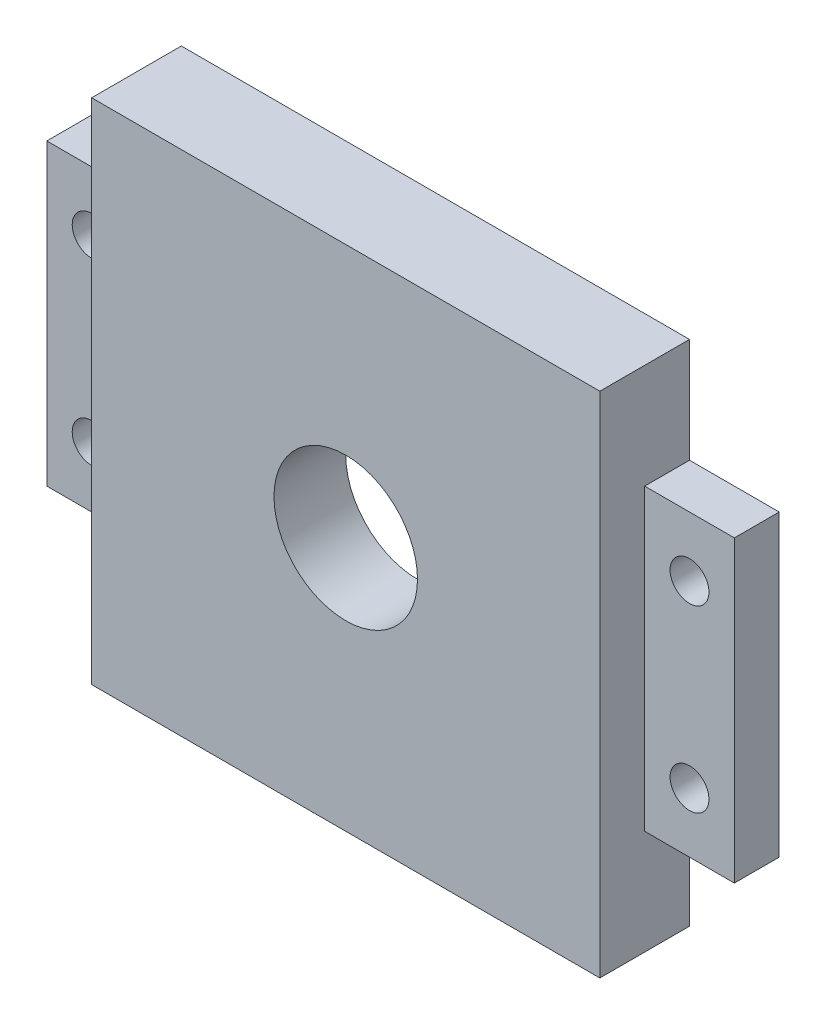
ISO-10303-21;
HEADER;
FILE_DESCRIPTION(('STEP AP214'),'2;1');
FILE_NAME('part.step','',(''),(''),'','','');
FILE_SCHEMA(('AUTOMOTIVE_DESIGN { 1 0 10303 214 1 1 1 1 }'));
ENDSEC;
DATA;
#1=APPLICATION_CONTEXT('core data for automotive mechanical design processes');
#2=APPLICATION_PROTOCOL_DEFINITION('international standard','automotive_design',2000,#1);
#3=PRODUCT_CONTEXT('',#1,'mechanical');
#4=PRODUCT('Part','Part','',(#3));
#5=PRODUCT_RELATED_PRODUCT_CATEGORY('part','',(#4));
#6=PRODUCT_DEFINITION_FORMATION('','',#4);
#7=PRODUCT_DEFINITION_CONTEXT('part definition',#1,'design');
#8=PRODUCT_DEFINITION('design','',#6,#7);
#9=PRODUCT_DEFINITION_SHAPE('','',#8);
#10=(LENGTH_UNIT() NAMED_UNIT(*) SI_UNIT(.MILLI.,.METRE.));
#11=(NAMED_UNIT(*) PLANE_ANGLE_UNIT() SI_UNIT($,.RADIAN.));
#12=(NAMED_UNIT(*) SI_UNIT($,.STERADIAN.) SOLID_ANGLE_UNIT());
#13=UNCERTAINTY_MEASURE_WITH_UNIT(LENGTH_MEASURE(1.E-05),#10,'distance_accuracy_value','');
#14=(GEOMETRIC_REPRESENTATION_CONTEXT(3) GLOBAL_UNCERTAINTY_ASSIGNED_CONTEXT((#13)) GLOBAL_UNIT_ASSIGNED_CONTEXT((#10,
#11,#12)) REPRESENTATION_CONTEXT('',''));
#15=CARTESIAN_POINT('',(0.,0.,0.));
#16=DIRECTION('',(0.,0.,1.));
#17=DIRECTION('',(1.,0.,0.));
#18=AXIS2_PLACEMENT_3D('',#15,#16,#17);
#19=CARTESIAN_POINT('',(0.,0.,15.));
#20=DIRECTION('',(0.,0.,-1.));
#21=DIRECTION('',(-1.,0.,0.));
#22=AXIS2_PLACEMENT_3D('',#19,#20,#21);
#23=CYLINDRICAL_SURFACE('',#22,12.);
#24=CARTESIAN_POINT('',(0.,0.,15.));
#25=DIRECTION('',(0.,0.,1.));
#26=DIRECTION('',(1.,0.,0.));
#27=AXIS2_PLACEMENT_3D('',#24,#25,#26);
#28=CIRCLE('',#27,12.);
#29=CARTESIAN_POINT('',(12.,0.,15.));
#30=VERTEX_POINT('',#29);
#31=EDGE_CURVE('E382',#30,#30,#28,.T.);
#32=ORIENTED_EDGE('',*,*,#31,.T.);
#33=EDGE_LOOP('',(#32));
#34=FACE_BOUND('',#33,.T.);
#35=CARTESIAN_POINT('',(0.,0.,3.));
#36=DIRECTION('',(0.,0.,-1.));
#37=DIRECTION('',(-1.,0.,0.));
#38=AXIS2_PLACEMENT_3D('',#35,#36,#37);
#39=CIRCLE('',#38,12.);
#40=CARTESIAN_POINT('',(-12.,0.,3.));
#41=VERTEX_POINT('',#40);
#42=EDGE_CURVE('E50',#41,#41,#39,.T.);
#43=ORIENTED_EDGE('',*,*,#42,.T.);
#44=EDGE_LOOP('',(#43));
#45=FACE_BOUND('',#44,.T.);
#46=ADVANCED_FACE('F45',(#34,#45),#23,.F.);
#47=CARTESIAN_POINT('',(-57.5,25.,15.));
#48=DIRECTION('',(0.,-1.,0.));
#49=DIRECTION('',(1.,0.,0.));
#50=AXIS2_PLACEMENT_3D('',#47,#48,#49);
#51=PLANE('',#50);
#52=DIRECTION('',(-1.,0.,0.));
#53=VECTOR('',#52,1.);
#54=CARTESIAN_POINT('',(-57.5,25.,7.5));
#55=LINE('',#54,#53);
#56=CARTESIAN_POINT('',(-42.5,25.,7.5));
#57=VERTEX_POINT('',#56);
#58=CARTESIAN_POINT('',(-57.5,25.,7.5));
#59=VERTEX_POINT('',#58);
#60=EDGE_CURVE('E139',#57,#59,#55,.T.);
#61=ORIENTED_EDGE('',*,*,#60,.F.);
#62=DIRECTION('',(0.,0.,-1.));
#63=VECTOR('',#62,1.);
#64=CARTESIAN_POINT('',(-42.5,25.,15.));
#65=LINE('',#64,#63);
#66=CARTESIAN_POINT('',(-42.5,25.,0.));
#67=VERTEX_POINT('',#66);
#68=EDGE_CURVE('E164',#57,#67,#65,.T.);
#69=ORIENTED_EDGE('',*,*,#68,.T.);
#70=DIRECTION('',(-1.,0.,0.));
#71=VECTOR('',#70,1.);
#72=CARTESIAN_POINT('',(-57.5,25.,0.));
#73=LINE('',#72,#71);
#74=CARTESIAN_POINT('',(-57.5,25.,0.));
#75=VERTEX_POINT('',#74);
#76=EDGE_CURVE('E414',#67,#75,#73,.T.);
#77=ORIENTED_EDGE('',*,*,#76,.T.);
#78=DIRECTION('',(0.,0.,-1.));
#79=VECTOR('',#78,1.);
#80=CARTESIAN_POINT('',(-57.5,25.,15.));
#81=LINE('',#80,#79);
#82=EDGE_CURVE('E160',#59,#75,#81,.T.);
#83=ORIENTED_EDGE('',*,*,#82,.F.);
#84=EDGE_LOOP('',(#61,#69,#77,#83));
#85=FACE_BOUND('',#84,.T.);
#86=ADVANCED_FACE('F240',(#85),#51,.F.);
#87=CARTESIAN_POINT('',(-57.5,-25.,15.));
#88=DIRECTION('',(1.,0.,0.));
#89=DIRECTION('',(0.,0.,-1.));
#90=AXIS2_PLACEMENT_3D('',#87,#88,#89);
#91=PLANE('',#90);
#92=DIRECTION('',(0.,-1.,0.));
#93=VECTOR('',#92,1.);
#94=CARTESIAN_POINT('',(-57.5,25.,7.5));
#95=LINE('',#94,#93);
#96=CARTESIAN_POINT('',(-57.5,-25.,7.5));
#97=VERTEX_POINT('',#96);
#98=EDGE_CURVE('E135',#59,#97,#95,.T.);
#99=ORIENTED_EDGE('',*,*,#98,.F.);
#100=ORIENTED_EDGE('',*,*,#82,.T.);
#101=DIRECTION('',(0.,-1.,0.));
#102=VECTOR('',#101,1.);
#103=CARTESIAN_POINT('',(-57.5,-25.,0.));
#104=LINE('',#103,#102);
#105=CARTESIAN_POINT('',(-57.5,-25.,0.));
#106=VERTEX_POINT('',#105);
#107=EDGE_CURVE('E157',#75,#106,#104,.T.);
#108=ORIENTED_EDGE('',*,*,#107,.T.);
#109=DIRECTION('',(0.,0.,-1.));
#110=VECTOR('',#109,1.);
#111=CARTESIAN_POINT('',(-57.5,-25.,15.));
#112=LINE('',#111,#110);
#113=EDGE_CURVE('E149',#97,#106,#112,.T.);
#114=ORIENTED_EDGE('',*,*,#113,.F.);
#115=EDGE_LOOP('',(#99,#100,#108,#114));
#116=FACE_BOUND('',#115,.T.);
#117=ADVANCED_FACE('F155',(#116),#91,.F.);
#118=CARTESIAN_POINT('',(-57.5,-25.,15.));
#119=DIRECTION('',(0.,1.,0.));
#120=DIRECTION('',(-1.,0.,0.));
#121=AXIS2_PLACEMENT_3D('',#118,#119,#120);
#122=PLANE('',#121);
#123=DIRECTION('',(1.,0.,0.));
#124=VECTOR('',#123,1.);
#125=CARTESIAN_POINT('',(-57.5,-25.,7.5));
#126=LINE('',#125,#124);
#127=CARTESIAN_POINT('',(-42.5,-25.,7.5));
#128=VERTEX_POINT('',#127);
#129=EDGE_CURVE('E63',#97,#128,#126,.T.);
#130=ORIENTED_EDGE('',*,*,#129,.F.);
#131=ORIENTED_EDGE('',*,*,#113,.T.);
#132=DIRECTION('',(1.,0.,0.));
#133=VECTOR('',#132,1.);
#134=CARTESIAN_POINT('',(-57.5,-25.,0.));
#135=LINE('',#134,#133);
#136=CARTESIAN_POINT('',(-42.5,-25.,0.));
#137=VERTEX_POINT('',#136);
#138=EDGE_CURVE('E420',#106,#137,#135,.T.);
#139=ORIENTED_EDGE('',*,*,#138,.T.);
#140=DIRECTION('',(0.,0.,-1.));
#141=VECTOR('',#140,1.);
#142=CARTESIAN_POINT('',(-42.5,-25.,15.));
#143=LINE('',#142,#141);
#144=EDGE_CURVE('E151',#128,#137,#143,.T.);
#145=ORIENTED_EDGE('',*,*,#144,.F.);
#146=EDGE_LOOP('',(#130,#131,#139,#145));
#147=FACE_BOUND('',#146,.T.);
#148=ADVANCED_FACE('F147',(#147),#122,.F.);
#149=CARTESIAN_POINT('',(-50.,15.,15.));
#150=DIRECTION('',(0.,0.,-1.));
#151=DIRECTION('',(-1.,0.,0.));
#152=AXIS2_PLACEMENT_3D('',#149,#150,#151);
#153=CYLINDRICAL_SURFACE('',#152,3.25);
#154=CARTESIAN_POINT('',(-50.,15.,0.));
#155=DIRECTION('',(0.,0.,-1.));
#156=DIRECTION('',(-1.,0.,0.));
#157=AXIS2_PLACEMENT_3D('',#154,#155,#156);
#158=CIRCLE('',#157,3.25);
#159=CARTESIAN_POINT('',(-53.25,15.,0.));
#160=VERTEX_POINT('',#159);
#161=EDGE_CURVE('E372',#160,#160,#158,.T.);
#162=ORIENTED_EDGE('',*,*,#161,.T.);
#163=EDGE_LOOP('',(#162));
#164=FACE_BOUND('',#163,.T.);
#165=CARTESIAN_POINT('',(-50.,15.,7.5));
#166=DIRECTION('',(0.,0.,1.));
#167=DIRECTION('',(1.,0.,0.));
#168=AXIS2_PLACEMENT_3D('',#165,#166,#167);
#169=CIRCLE('',#168,3.25);
#170=CARTESIAN_POINT('',(-46.75,15.,7.5));
#171=VERTEX_POINT('',#170);
#172=EDGE_CURVE('E188',#171,#171,#169,.F.);
#173=ORIENTED_EDGE('',*,*,#172,.F.);
#174=EDGE_LOOP('',(#173));
#175=FACE_BOUND('',#174,.T.);
#176=ADVANCED_FACE('F287',(#164,#175),#153,.F.);
#177=CARTESIAN_POINT('',(-50.,-15.,15.));
#178=DIRECTION('',(0.,0.,-1.));
#179=DIRECTION('',(-1.,0.,0.));
#180=AXIS2_PLACEMENT_3D('',#177,#178,#179);
#181=CYLINDRICAL_SURFACE('',#180,3.25);
#182=CARTESIAN_POINT('',(-50.,-15.,0.));
#183=DIRECTION('',(0.,0.,-1.));
#184=DIRECTION('',(-1.,0.,0.));
#185=AXIS2_PLACEMENT_3D('',#182,#183,#184);
#186=CIRCLE('',#185,3.25);
#187=CARTESIAN_POINT('',(-53.25,-15.,0.));
#188=VERTEX_POINT('',#187);
#189=EDGE_CURVE('E366',#188,#188,#186,.T.);
#190=ORIENTED_EDGE('',*,*,#189,.T.);
#191=EDGE_LOOP('',(#190));
#192=FACE_BOUND('',#191,.T.);
#193=CARTESIAN_POINT('',(-50.,-15.,7.5));
#194=DIRECTION('',(0.,0.,1.));
#195=DIRECTION('',(1.,0.,0.));
#196=AXIS2_PLACEMENT_3D('',#193,#194,#195);
#197=CIRCLE('',#196,3.25);
#198=CARTESIAN_POINT('',(-46.75,-15.,7.5));
#199=VERTEX_POINT('',#198);
#200=EDGE_CURVE('E184',#199,#199,#197,.F.);
#201=ORIENTED_EDGE('',*,*,#200,.F.);
#202=EDGE_LOOP('',(#201));
#203=FACE_BOUND('',#202,.T.);
#204=ADVANCED_FACE('F258',(#192,#203),#181,.F.);
#205=CARTESIAN_POINT('',(0.,0.,15.));
#206=DIRECTION('',(0.,0.,1.));
#207=DIRECTION('',(1.,0.,0.));
#208=AXIS2_PLACEMENT_3D('',#205,#206,#207);
#209=PLANE('',#208);
#210=DIRECTION('',(0.,-1.,0.));
#211=VECTOR('',#210,1.);
#212=CARTESIAN_POINT('',(-42.5,25.,15.));
#213=LINE('',#212,#211);
#214=CARTESIAN_POINT('',(-42.5,42.5,15.));
#215=VERTEX_POINT('',#214);
#216=CARTESIAN_POINT('',(-42.5,-42.5,15.));
#217=VERTEX_POINT('',#216);
#218=EDGE_CURVE('E393',#215,#217,#213,.T.);
#219=ORIENTED_EDGE('',*,*,#218,.T.);
#220=DIRECTION('',(1.,0.,0.));
#221=VECTOR('',#220,1.);
#222=CARTESIAN_POINT('',(42.5,-42.5,15.));
#223=LINE('',#222,#221);
#224=CARTESIAN_POINT('',(42.5,-42.5,15.));
#225=VERTEX_POINT('',#224);
#226=EDGE_CURVE('E396',#217,#225,#223,.T.);
#227=ORIENTED_EDGE('',*,*,#226,.T.);
#228=DIRECTION('',(0.,1.,0.));
#229=VECTOR('',#228,1.);
#230=CARTESIAN_POINT('',(42.5,25.,15.));
#231=LINE('',#230,#229);
#232=CARTESIAN_POINT('',(42.5,42.5,15.));
#233=VERTEX_POINT('',#232);
#234=EDGE_CURVE('E386',#225,#233,#231,.T.);
#235=ORIENTED_EDGE('',*,*,#234,.T.);
#236=DIRECTION('',(-1.,0.,0.));
#237=VECTOR('',#236,1.);
#238=CARTESIAN_POINT('',(42.5,42.5,15.));
#239=LINE('',#238,#237);
#240=EDGE_CURVE('E389',#233,#215,#239,.T.);
#241=ORIENTED_EDGE('',*,*,#240,.T.);
#242=EDGE_LOOP('',(#219,#227,#235,#241));
#243=FACE_BOUND('',#242,.T.);
#244=ORIENTED_EDGE('',*,*,#31,.F.);
#245=EDGE_LOOP('',(#244));
#246=FACE_BOUND('',#245,.T.);
#247=ADVANCED_FACE('F254',(#243,#246),#209,.T.);
#248=CARTESIAN_POINT('',(0.,0.,0.));
#249=DIRECTION('',(0.,0.,1.));
#250=DIRECTION('',(1.,0.,0.));
#251=AXIS2_PLACEMENT_3D('',#248,#249,#250);
#252=PLANE('',#251);
#253=CARTESIAN_POINT('',(0.,0.,0.));
#254=DIRECTION('',(0.,0.,-1.));
#255=DIRECTION('',(-1.,0.,0.));
#256=AXIS2_PLACEMENT_3D('',#253,#254,#255);
#257=CIRCLE('',#256,35.);
#258=CARTESIAN_POINT('',(-35.,0.,0.));
#259=VERTEX_POINT('',#258);
#260=EDGE_CURVE('E339',#259,#259,#257,.T.);
#261=ORIENTED_EDGE('',*,*,#260,.F.);
#262=EDGE_LOOP('',(#261));
#263=FACE_BOUND('',#262,.T.);
#264=CARTESIAN_POINT('',(31.8198051533945,-31.8198051533947,0.));
#265=DIRECTION('',(0.,0.,1.));
#266=DIRECTION('',(1.,0.,0.));
#267=AXIS2_PLACEMENT_3D('',#264,#265,#266);
#268=CIRCLE('',#267,3.00000000000003);
#269=CARTESIAN_POINT('',(34.8198051533946,-31.8198051533947,0.));
#270=VERTEX_POINT('',#269);
#271=EDGE_CURVE('E209',#270,#270,#268,.T.);
#272=ORIENTED_EDGE('',*,*,#271,.T.);
#273=EDGE_LOOP('',(#272));
#274=FACE_BOUND('',#273,.T.);
#275=CARTESIAN_POINT('',(-31.8198051533946,-31.8198051533946,0.));
#276=DIRECTION('',(0.,0.,1.));
#277=DIRECTION('',(1.,0.,0.));
#278=AXIS2_PLACEMENT_3D('',#275,#276,#277);
#279=CIRCLE('',#278,3.00000000000003);
#280=CARTESIAN_POINT('',(-28.8198051533946,-31.8198051533946,0.));
#281=VERTEX_POINT('',#280);
#282=EDGE_CURVE('E205',#281,#281,#279,.T.);
#283=ORIENTED_EDGE('',*,*,#282,.T.);
#284=EDGE_LOOP('',(#283));
#285=FACE_BOUND('',#284,.T.);
#286=CARTESIAN_POINT('',(-31.8198051533943,31.819805153395,0.));
#287=DIRECTION('',(0.,0.,1.));
#288=DIRECTION('',(1.,0.,0.));
#289=AXIS2_PLACEMENT_3D('',#286,#287,#288);
#290=CIRCLE('',#289,3.00000000000003);
#291=CARTESIAN_POINT('',(-28.8198051533943,31.819805153395,0.));
#292=VERTEX_POINT('',#291);
#293=EDGE_CURVE('E201',#292,#292,#290,.T.);
#294=ORIENTED_EDGE('',*,*,#293,.T.);
#295=EDGE_LOOP('',(#294));
#296=FACE_BOUND('',#295,.T.);
#297=CARTESIAN_POINT('',(31.8198051533946,31.8198051533946,0.));
#298=DIRECTION('',(0.,0.,1.));
#299=DIRECTION('',(1.,0.,0.));
#300=AXIS2_PLACEMENT_3D('',#297,#298,#299);
#301=CIRCLE('',#300,3.00000000000003);
#302=CARTESIAN_POINT('',(34.8198051533947,31.8198051533946,0.));
#303=VERTEX_POINT('',#302);
#304=EDGE_CURVE('E197',#303,#303,#301,.T.);
#305=ORIENTED_EDGE('',*,*,#304,.T.);
#306=EDGE_LOOP('',(#305));
#307=FACE_BOUND('',#306,.T.);
#308=ORIENTED_EDGE('',*,*,#189,.F.);
#309=EDGE_LOOP('',(#308));
#310=FACE_BOUND('',#309,.T.);
#311=ORIENTED_EDGE('',*,*,#161,.F.);
#312=EDGE_LOOP('',(#311));
#313=FACE_BOUND('',#312,.T.);
#314=CARTESIAN_POINT('',(50.,15.,0.));
#315=DIRECTION('',(0.,0.,-1.));
#316=DIRECTION('',(-1.,0.,0.));
#317=AXIS2_PLACEMENT_3D('',#314,#315,#316);
#318=CIRCLE('',#317,3.25);
#319=CARTESIAN_POINT('',(46.75,15.,0.));
#320=VERTEX_POINT('',#319);
#321=EDGE_CURVE('E367',#320,#320,#318,.T.);
#322=ORIENTED_EDGE('',*,*,#321,.F.);
#323=EDGE_LOOP('',(#322));
#324=FACE_BOUND('',#323,.T.);
#325=CARTESIAN_POINT('',(50.,-15.,0.));
#326=DIRECTION('',(0.,0.,-1.));
#327=DIRECTION('',(-1.,0.,0.));
#328=AXIS2_PLACEMENT_3D('',#325,#326,#327);
#329=CIRCLE('',#328,3.25);
#330=CARTESIAN_POINT('',(46.75,-15.,0.));
#331=VERTEX_POINT('',#330);
#332=EDGE_CURVE('E371',#331,#331,#329,.T.);
#333=ORIENTED_EDGE('',*,*,#332,.F.);
#334=EDGE_LOOP('',(#333));
#335=FACE_BOUND('',#334,.T.);
#336=DIRECTION('',(-1.,0.,0.));
#337=VECTOR('',#336,1.);
#338=CARTESIAN_POINT('',(42.5,25.,0.));
#339=LINE('',#338,#337);
#340=CARTESIAN_POINT('',(57.5,25.,0.));
#341=VERTEX_POINT('',#340);
#342=CARTESIAN_POINT('',(42.5,25.,0.));
#343=VERTEX_POINT('',#342);
#344=EDGE_CURVE('E385',#341,#343,#339,.T.);
#345=ORIENTED_EDGE('',*,*,#344,.F.);
#346=DIRECTION('',(0.,1.,0.));
#347=VECTOR('',#346,1.);
#348=CARTESIAN_POINT('',(57.5,-25.,0.));
#349=LINE('',#348,#347);
#350=CARTESIAN_POINT('',(57.5,-25.,0.));
#351=VERTEX_POINT('',#350);
#352=EDGE_CURVE('E390',#351,#341,#349,.T.);
#353=ORIENTED_EDGE('',*,*,#352,.F.);
#354=DIRECTION('',(1.,0.,0.));
#355=VECTOR('',#354,1.);
#356=CARTESIAN_POINT('',(42.5,-25.,0.));
#357=LINE('',#356,#355);
#358=CARTESIAN_POINT('',(42.5,-25.,0.));
#359=VERTEX_POINT('',#358);
#360=EDGE_CURVE('E433',#359,#351,#357,.T.);
#361=ORIENTED_EDGE('',*,*,#360,.F.);
#362=DIRECTION('',(0.,1.,0.));
#363=VECTOR('',#362,1.);
#364=CARTESIAN_POINT('',(42.5,-42.5,0.));
#365=LINE('',#364,#363);
#366=CARTESIAN_POINT('',(42.5,-42.5,0.));
#367=VERTEX_POINT('',#366);
#368=EDGE_CURVE('E429',#367,#359,#365,.T.);
#369=ORIENTED_EDGE('',*,*,#368,.F.);
#370=DIRECTION('',(1.,0.,0.));
#371=VECTOR('',#370,1.);
#372=CARTESIAN_POINT('',(42.5,-42.5,0.));
#373=LINE('',#372,#371);
#374=CARTESIAN_POINT('',(-42.5,-42.5,0.));
#375=VERTEX_POINT('',#374);
#376=EDGE_CURVE('E426',#375,#367,#373,.T.);
#377=ORIENTED_EDGE('',*,*,#376,.F.);
#378=DIRECTION('',(0.,-1.,0.));
#379=VECTOR('',#378,1.);
#380=CARTESIAN_POINT('',(-42.5,-42.5,0.));
#381=LINE('',#380,#379);
#382=EDGE_CURVE('E423',#137,#375,#381,.T.);
#383=ORIENTED_EDGE('',*,*,#382,.F.);
#384=ORIENTED_EDGE('',*,*,#138,.F.);
#385=ORIENTED_EDGE('',*,*,#107,.F.);
#386=ORIENTED_EDGE('',*,*,#76,.F.);
#387=DIRECTION('',(0.,-1.,0.));
#388=VECTOR('',#387,1.);
#389=CARTESIAN_POINT('',(-42.5,25.,0.));
#390=LINE('',#389,#388);
#391=CARTESIAN_POINT('',(-42.5,42.5,0.));
#392=VERTEX_POINT('',#391);
#393=EDGE_CURVE('E410',#392,#67,#390,.T.);
#394=ORIENTED_EDGE('',*,*,#393,.F.);
#395=DIRECTION('',(-1.,0.,0.));
#396=VECTOR('',#395,1.);
#397=CARTESIAN_POINT('',(42.5,42.5,0.));
#398=LINE('',#397,#396);
#399=CARTESIAN_POINT('',(42.5,42.5,0.));
#400=VERTEX_POINT('',#399);
#401=EDGE_CURVE('E407',#400,#392,#398,.T.);
#402=ORIENTED_EDGE('',*,*,#401,.F.);
#403=DIRECTION('',(0.,1.,0.));
#404=VECTOR('',#403,1.);
#405=CARTESIAN_POINT('',(42.5,25.,0.));
#406=LINE('',#405,#404);
#407=EDGE_CURVE('E404',#343,#400,#406,.T.);
#408=ORIENTED_EDGE('',*,*,#407,.F.);
#409=EDGE_LOOP('',(#345,#353,#361,#369,#377,#383,#384,#385,#386,#394,#402,#408));
#410=FACE_BOUND('',#409,.T.);
#411=ADVANCED_FACE('F257',(#263,#274,#285,#296,#307,#310,#313,#324,#335,#410),#252,.F.);
#412=CARTESIAN_POINT('',(42.5,25.,15.));
#413=DIRECTION('',(0.,-1.,0.));
#414=DIRECTION('',(0.,0.,-1.));
#415=AXIS2_PLACEMENT_3D('',#412,#413,#414);
#416=PLANE('',#415);
#417=DIRECTION('',(0.,0.,-1.));
#418=VECTOR('',#417,1.);
#419=CARTESIAN_POINT('',(42.5,25.,15.));
#420=LINE('',#419,#418);
#421=CARTESIAN_POINT('',(42.5,25.,7.5));
#422=VERTEX_POINT('',#421);
#423=EDGE_CURVE('E180',#422,#343,#420,.T.);
#424=ORIENTED_EDGE('',*,*,#423,.F.);
#425=DIRECTION('',(-1.,0.,0.));
#426=VECTOR('',#425,1.);
#427=CARTESIAN_POINT('',(57.5,25.,7.5));
#428=LINE('',#427,#426);
#429=CARTESIAN_POINT('',(57.5,25.,7.5));
#430=VERTEX_POINT('',#429);
#431=EDGE_CURVE('E351',#430,#422,#428,.T.);
#432=ORIENTED_EDGE('',*,*,#431,.F.);
#433=DIRECTION('',(0.,0.,-1.));
#434=VECTOR('',#433,1.);
#435=CARTESIAN_POINT('',(57.5,25.,15.));
#436=LINE('',#435,#434);
#437=EDGE_CURVE('E400',#430,#341,#436,.T.);
#438=ORIENTED_EDGE('',*,*,#437,.T.);
#439=ORIENTED_EDGE('',*,*,#344,.T.);
#440=EDGE_LOOP('',(#424,#432,#438,#439));
#441=FACE_BOUND('',#440,.T.);
#442=ADVANCED_FACE('F262',(#441),#416,.F.);
#443=CARTESIAN_POINT('',(42.5,42.5,15.));
#444=DIRECTION('',(0.,-1.,0.));
#445=DIRECTION('',(0.,0.,-1.));
#446=AXIS2_PLACEMENT_3D('',#443,#444,#445);
#447=PLANE('',#446);
#448=ORIENTED_EDGE('',*,*,#401,.T.);
#449=DIRECTION('',(0.,0.,-1.));
#450=VECTOR('',#449,1.);
#451=CARTESIAN_POINT('',(-42.5,42.5,15.));
#452=LINE('',#451,#450);
#453=EDGE_CURVE('E172',#215,#392,#452,.T.);
#454=ORIENTED_EDGE('',*,*,#453,.F.);
#455=ORIENTED_EDGE('',*,*,#240,.F.);
#456=DIRECTION('',(0.,0.,-1.));
#457=VECTOR('',#456,1.);
#458=CARTESIAN_POINT('',(42.5,42.5,15.));
#459=LINE('',#458,#457);
#460=EDGE_CURVE('E176',#233,#400,#459,.T.);
#461=ORIENTED_EDGE('',*,*,#460,.T.);
#462=EDGE_LOOP('',(#448,#454,#455,#461));
#463=FACE_BOUND('',#462,.T.);
#464=ADVANCED_FACE('F283',(#463),#447,.F.);
#465=CARTESIAN_POINT('',(-42.5,-42.5,15.));
#466=DIRECTION('',(1.,0.,0.));
#467=DIRECTION('',(0.,1.,0.));
#468=AXIS2_PLACEMENT_3D('',#465,#466,#467);
#469=PLANE('',#468);
#470=ORIENTED_EDGE('',*,*,#382,.T.);
#471=DIRECTION('',(0.,0.,-1.));
#472=VECTOR('',#471,1.);
#473=CARTESIAN_POINT('',(-42.5,-42.5,15.));
#474=LINE('',#473,#472);
#475=EDGE_CURVE('E166',#217,#375,#474,.T.);
#476=ORIENTED_EDGE('',*,*,#475,.F.);
#477=ORIENTED_EDGE('',*,*,#218,.F.);
#478=ORIENTED_EDGE('',*,*,#453,.T.);
#479=ORIENTED_EDGE('',*,*,#393,.T.);
#480=ORIENTED_EDGE('',*,*,#68,.F.);
#481=DIRECTION('',(0.,1.,0.));
#482=VECTOR('',#481,1.);
#483=CARTESIAN_POINT('',(-42.5,25.,7.5));
#484=LINE('',#483,#482);
#485=EDGE_CURVE('E153',#128,#57,#484,.T.);
#486=ORIENTED_EDGE('',*,*,#485,.F.);
#487=ORIENTED_EDGE('',*,*,#144,.T.);
#488=EDGE_LOOP('',(#470,#476,#477,#478,#479,#480,#486,#487));
#489=FACE_BOUND('',#488,.T.);
#490=ADVANCED_FACE('F279',(#489),#469,.F.);
#491=CARTESIAN_POINT('',(42.5,-42.5,15.));
#492=DIRECTION('',(0.,1.,0.));
#493=DIRECTION('',(0.,0.,1.));
#494=AXIS2_PLACEMENT_3D('',#491,#492,#493);
#495=PLANE('',#494);
#496=ORIENTED_EDGE('',*,*,#376,.T.);
#497=DIRECTION('',(0.,0.,-1.));
#498=VECTOR('',#497,1.);
#499=CARTESIAN_POINT('',(42.5,-42.5,15.));
#500=LINE('',#499,#498);
#501=EDGE_CURVE('E448',#225,#367,#500,.T.);
#502=ORIENTED_EDGE('',*,*,#501,.F.);
#503=ORIENTED_EDGE('',*,*,#226,.F.);
#504=ORIENTED_EDGE('',*,*,#475,.T.);
#505=EDGE_LOOP('',(#496,#502,#503,#504));
#506=FACE_BOUND('',#505,.T.);
#507=ADVANCED_FACE('F275',(#506),#495,.F.);
#508=CARTESIAN_POINT('',(42.5,-42.5,15.));
#509=DIRECTION('',(-1.,0.,0.));
#510=DIRECTION('',(0.,-1.,0.));
#511=AXIS2_PLACEMENT_3D('',#508,#509,#510);
#512=PLANE('',#511);
#513=ORIENTED_EDGE('',*,*,#368,.T.);
#514=DIRECTION('',(0.,0.,-1.));
#515=VECTOR('',#514,1.);
#516=CARTESIAN_POINT('',(42.5,-25.,15.));
#517=LINE('',#516,#515);
#518=CARTESIAN_POINT('',(42.5,-25.,7.5));
#519=VERTEX_POINT('',#518);
#520=EDGE_CURVE('E445',#519,#359,#517,.T.);
#521=ORIENTED_EDGE('',*,*,#520,.F.);
#522=DIRECTION('',(0.,-1.,0.));
#523=VECTOR('',#522,1.);
#524=CARTESIAN_POINT('',(42.5,25.,7.5));
#525=LINE('',#524,#523);
#526=EDGE_CURVE('E355',#422,#519,#525,.T.);
#527=ORIENTED_EDGE('',*,*,#526,.F.);
#528=ORIENTED_EDGE('',*,*,#423,.T.);
#529=ORIENTED_EDGE('',*,*,#407,.T.);
#530=ORIENTED_EDGE('',*,*,#460,.F.);
#531=ORIENTED_EDGE('',*,*,#234,.F.);
#532=ORIENTED_EDGE('',*,*,#501,.T.);
#533=EDGE_LOOP('',(#513,#521,#527,#528,#529,#530,#531,#532));
#534=FACE_BOUND('',#533,.T.);
#535=ADVANCED_FACE('F271',(#534),#512,.F.);
#536=CARTESIAN_POINT('',(42.5,-25.,15.));
#537=DIRECTION('',(0.,1.,0.));
#538=DIRECTION('',(-1.,0.,0.));
#539=AXIS2_PLACEMENT_3D('',#536,#537,#538);
#540=PLANE('',#539);
#541=DIRECTION('',(0.,0.,-1.));
#542=VECTOR('',#541,1.);
#543=CARTESIAN_POINT('',(57.5,-25.,15.));
#544=LINE('',#543,#542);
#545=CARTESIAN_POINT('',(57.5,-25.,7.5));
#546=VERTEX_POINT('',#545);
#547=EDGE_CURVE('E442',#546,#351,#544,.T.);
#548=ORIENTED_EDGE('',*,*,#547,.F.);
#549=DIRECTION('',(1.,0.,0.));
#550=VECTOR('',#549,1.);
#551=CARTESIAN_POINT('',(57.5,-25.,7.5));
#552=LINE('',#551,#550);
#553=EDGE_CURVE('E71',#519,#546,#552,.T.);
#554=ORIENTED_EDGE('',*,*,#553,.F.);
#555=ORIENTED_EDGE('',*,*,#520,.T.);
#556=ORIENTED_EDGE('',*,*,#360,.T.);
#557=EDGE_LOOP('',(#548,#554,#555,#556));
#558=FACE_BOUND('',#557,.T.);
#559=ADVANCED_FACE('F267',(#558),#540,.F.);
#560=CARTESIAN_POINT('',(57.5,-25.,15.));
#561=DIRECTION('',(-1.,0.,0.));
#562=DIRECTION('',(0.,0.,1.));
#563=AXIS2_PLACEMENT_3D('',#560,#561,#562);
#564=PLANE('',#563);
#565=ORIENTED_EDGE('',*,*,#437,.F.);
#566=DIRECTION('',(0.,1.,0.));
#567=VECTOR('',#566,1.);
#568=CARTESIAN_POINT('',(57.5,25.,7.5));
#569=LINE('',#568,#567);
#570=EDGE_CURVE('E333',#546,#430,#569,.T.);
#571=ORIENTED_EDGE('',*,*,#570,.F.);
#572=ORIENTED_EDGE('',*,*,#547,.T.);
#573=ORIENTED_EDGE('',*,*,#352,.T.);
#574=EDGE_LOOP('',(#565,#571,#572,#573));
#575=FACE_BOUND('',#574,.T.);
#576=ADVANCED_FACE('F264',(#575),#564,.F.);
#577=CARTESIAN_POINT('',(50.,-15.,15.));
#578=DIRECTION('',(0.,0.,-1.));
#579=DIRECTION('',(-1.,0.,0.));
#580=AXIS2_PLACEMENT_3D('',#577,#578,#579);
#581=CYLINDRICAL_SURFACE('',#580,3.25);
#582=CARTESIAN_POINT('',(50.,-15.,7.5));
#583=DIRECTION('',(0.,0.,-1.));
#584=DIRECTION('',(-1.,0.,0.));
#585=AXIS2_PLACEMENT_3D('',#582,#583,#584);
#586=CIRCLE('',#585,3.25);
#587=CARTESIAN_POINT('',(46.75,-15.,7.5));
#588=VERTEX_POINT('',#587);
#589=EDGE_CURVE('E193',#588,#588,#586,.F.);
#590=ORIENTED_EDGE('',*,*,#589,.T.);
#591=EDGE_LOOP('',(#590));
#592=FACE_BOUND('',#591,.T.);
#593=ORIENTED_EDGE('',*,*,#332,.T.);
#594=EDGE_LOOP('',(#593));
#595=FACE_BOUND('',#594,.T.);
#596=ADVANCED_FACE('F252',(#592,#595),#581,.F.);
#597=CARTESIAN_POINT('',(50.,15.,15.));
#598=DIRECTION('',(0.,0.,-1.));
#599=DIRECTION('',(-1.,0.,0.));
#600=AXIS2_PLACEMENT_3D('',#597,#598,#599);
#601=CYLINDRICAL_SURFACE('',#600,3.25);
#602=CARTESIAN_POINT('',(50.,15.,7.5));
#603=DIRECTION('',(0.,0.,-1.));
#604=DIRECTION('',(-1.,0.,0.));
#605=AXIS2_PLACEMENT_3D('',#602,#603,#604);
#606=CIRCLE('',#605,3.25);
#607=CARTESIAN_POINT('',(46.75,15.,7.5));
#608=VERTEX_POINT('',#607);
#609=EDGE_CURVE('E189',#608,#608,#606,.F.);
#610=ORIENTED_EDGE('',*,*,#609,.T.);
#611=EDGE_LOOP('',(#610));
#612=FACE_BOUND('',#611,.T.);
#613=ORIENTED_EDGE('',*,*,#321,.T.);
#614=EDGE_LOOP('',(#613));
#615=FACE_BOUND('',#614,.T.);
#616=ADVANCED_FACE('F488',(#612,#615),#601,.F.);
#617=CARTESIAN_POINT('',(0.,0.,7.5));
#618=DIRECTION('',(0.,0.,1.));
#619=DIRECTION('',(1.,0.,0.));
#620=AXIS2_PLACEMENT_3D('',#617,#618,#619);
#621=PLANE('',#620);
#622=ORIENTED_EDGE('',*,*,#98,.T.);
#623=ORIENTED_EDGE('',*,*,#129,.T.);
#624=ORIENTED_EDGE('',*,*,#485,.T.);
#625=ORIENTED_EDGE('',*,*,#60,.T.);
#626=EDGE_LOOP('',(#622,#623,#624,#625));
#627=FACE_BOUND('',#626,.T.);
#628=ORIENTED_EDGE('',*,*,#200,.T.);
#629=EDGE_LOOP('',(#628));
#630=FACE_BOUND('',#629,.T.);
#631=ORIENTED_EDGE('',*,*,#172,.T.);
#632=EDGE_LOOP('',(#631));
#633=FACE_BOUND('',#632,.T.);
#634=ADVANCED_FACE('F136',(#627,#630,#633),#621,.T.);
#635=CARTESIAN_POINT('',(0.,0.,7.5));
#636=DIRECTION('',(0.,0.,-1.));
#637=DIRECTION('',(-1.,0.,0.));
#638=AXIS2_PLACEMENT_3D('',#635,#636,#637);
#639=PLANE('',#638);
#640=ORIENTED_EDGE('',*,*,#609,.F.);
#641=EDGE_LOOP('',(#640));
#642=FACE_BOUND('',#641,.T.);
#643=ORIENTED_EDGE('',*,*,#570,.T.);
#644=ORIENTED_EDGE('',*,*,#431,.T.);
#645=ORIENTED_EDGE('',*,*,#526,.T.);
#646=ORIENTED_EDGE('',*,*,#553,.T.);
#647=EDGE_LOOP('',(#643,#644,#645,#646));
#648=FACE_BOUND('',#647,.T.);
#649=ORIENTED_EDGE('',*,*,#589,.F.);
#650=EDGE_LOOP('',(#649));
#651=FACE_BOUND('',#650,.T.);
#652=ADVANCED_FACE('F478',(#642,#648,#651),#639,.F.);
#653=CARTESIAN_POINT('',(31.8198051533946,31.8198051533946,10.));
#654=DIRECTION('',(0.,0.,-1.));
#655=DIRECTION('',(-1.,0.,0.));
#656=AXIS2_PLACEMENT_3D('',#653,#654,#655);
#657=CYLINDRICAL_SURFACE('',#656,2.5);
#658=CARTESIAN_POINT('',(31.8198051533946,31.8198051533946,0.50000000000004));
#659=DIRECTION('',(0.,0.,1.));
#660=DIRECTION('',(1.,0.,0.));
#661=AXIS2_PLACEMENT_3D('',#658,#659,#660);
#662=CIRCLE('',#661,2.5);
#663=CARTESIAN_POINT('',(34.3198051533946,31.8198051533946,0.50000000000004));
#664=VERTEX_POINT('',#663);
#665=EDGE_CURVE('E11',#664,#664,#662,.F.);
#666=ORIENTED_EDGE('',*,*,#665,.T.);
#667=EDGE_LOOP('',(#666));
#668=FACE_BOUND('',#667,.T.);
#669=CARTESIAN_POINT('',(31.8198051533946,31.8198051533946,10.));
#670=DIRECTION('',(0.,0.,-1.));
#671=DIRECTION('',(-1.,0.,0.));
#672=AXIS2_PLACEMENT_3D('',#669,#670,#671);
#673=CIRCLE('',#672,2.5);
#674=CARTESIAN_POINT('',(29.3198051533946,31.8198051533946,10.));
#675=VERTEX_POINT('',#674);
#676=EDGE_CURVE('E327',#675,#675,#673,.T.);
#677=ORIENTED_EDGE('',*,*,#676,.F.);
#678=EDGE_LOOP('',(#677));
#679=FACE_BOUND('',#678,.T.);
#680=ADVANCED_FACE('F481',(#668,#679),#657,.F.);
#681=CARTESIAN_POINT('',(31.8198051533946,31.8198051533946,10.));
#682=DIRECTION('',(0.,0.,-1.));
#683=DIRECTION('',(-1.,0.,0.));
#684=AXIS2_PLACEMENT_3D('',#681,#682,#683);
#685=PLANE('',#684);
#686=ORIENTED_EDGE('',*,*,#676,.T.);
#687=EDGE_LOOP('',(#686));
#688=FACE_BOUND('',#687,.T.);
#689=ADVANCED_FACE('F586',(#688),#685,.T.);
#690=CARTESIAN_POINT('',(-31.8198051533943,31.819805153395,10.));
#691=DIRECTION('',(0.,0.,-1.));
#692=DIRECTION('',(-1.,0.,0.));
#693=AXIS2_PLACEMENT_3D('',#690,#691,#692);
#694=CYLINDRICAL_SURFACE('',#693,2.5);
#695=CARTESIAN_POINT('',(-31.8198051533943,31.819805153395,0.50000000000004));
#696=DIRECTION('',(0.,0.,1.));
#697=DIRECTION('',(1.,0.,0.));
#698=AXIS2_PLACEMENT_3D('',#695,#696,#697);
#699=CIRCLE('',#698,2.5);
#700=CARTESIAN_POINT('',(-29.3198051533943,31.819805153395,0.50000000000004));
#701=VERTEX_POINT('',#700);
#702=EDGE_CURVE('E56',#701,#701,#699,.F.);
#703=ORIENTED_EDGE('',*,*,#702,.T.);
#704=EDGE_LOOP('',(#703));
#705=FACE_BOUND('',#704,.T.);
#706=CARTESIAN_POINT('',(-31.8198051533943,31.819805153395,10.));
#707=DIRECTION('',(0.,0.,-1.));
#708=DIRECTION('',(0.,-1.,0.));
#709=AXIS2_PLACEMENT_3D('',#706,#707,#708);
#710=CIRCLE('',#709,2.5);
#711=CARTESIAN_POINT('',(-31.8198051533943,29.319805153395,10.));
#712=VERTEX_POINT('',#711);
#713=EDGE_CURVE('E336',#712,#712,#710,.T.);
#714=ORIENTED_EDGE('',*,*,#713,.F.);
#715=EDGE_LOOP('',(#714));
#716=FACE_BOUND('',#715,.T.);
#717=ADVANCED_FACE('F221',(#705,#716),#694,.F.);
#718=CARTESIAN_POINT('',(-31.8198051533943,31.819805153395,10.));
#719=DIRECTION('',(0.,0.,-1.));
#720=DIRECTION('',(0.,-1.,0.));
#721=AXIS2_PLACEMENT_3D('',#718,#719,#720);
#722=PLANE('',#721);
#723=ORIENTED_EDGE('',*,*,#713,.T.);
#724=EDGE_LOOP('',(#723));
#725=FACE_BOUND('',#724,.T.);
#726=ADVANCED_FACE('F598',(#725),#722,.T.);
#727=CARTESIAN_POINT('',(-31.8198051533946,-31.8198051533946,10.));
#728=DIRECTION('',(0.,0.,-1.));
#729=DIRECTION('',(-1.,0.,0.));
#730=AXIS2_PLACEMENT_3D('',#727,#728,#729);
#731=CYLINDRICAL_SURFACE('',#730,2.5);
#732=CARTESIAN_POINT('',(-31.8198051533946,-31.8198051533946,0.50000000000004));
#733=DIRECTION('',(0.,0.,1.));
#734=DIRECTION('',(1.,0.,0.));
#735=AXIS2_PLACEMENT_3D('',#732,#733,#734);
#736=CIRCLE('',#735,2.5);
#737=CARTESIAN_POINT('',(-29.3198051533946,-31.8198051533946,0.50000000000004));
#738=VERTEX_POINT('',#737);
#739=EDGE_CURVE('E213',#738,#738,#736,.F.);
#740=ORIENTED_EDGE('',*,*,#739,.T.);
#741=EDGE_LOOP('',(#740));
#742=FACE_BOUND('',#741,.T.);
#743=CARTESIAN_POINT('',(-31.8198051533946,-31.8198051533946,10.));
#744=DIRECTION('',(0.,0.,-1.));
#745=DIRECTION('',(1.,0.,0.));
#746=AXIS2_PLACEMENT_3D('',#743,#744,#745);
#747=CIRCLE('',#746,2.5);
#748=CARTESIAN_POINT('',(-29.3198051533946,-31.8198051533946,10.));
#749=VERTEX_POINT('',#748);
#750=EDGE_CURVE('E328',#749,#749,#747,.T.);
#751=ORIENTED_EDGE('',*,*,#750,.F.);
#752=EDGE_LOOP('',(#751));
#753=FACE_BOUND('',#752,.T.);
#754=ADVANCED_FACE('F603',(#742,#753),#731,.F.);
#755=CARTESIAN_POINT('',(-31.8198051533946,-31.8198051533946,10.));
#756=DIRECTION('',(0.,0.,-1.));
#757=DIRECTION('',(1.,0.,0.));
#758=AXIS2_PLACEMENT_3D('',#755,#756,#757);
#759=PLANE('',#758);
#760=ORIENTED_EDGE('',*,*,#750,.T.);
#761=EDGE_LOOP('',(#760));
#762=FACE_BOUND('',#761,.T.);
#763=ADVANCED_FACE('F321',(#762),#759,.T.);
#764=CARTESIAN_POINT('',(31.8198051533945,-31.8198051533947,10.));
#765=DIRECTION('',(0.,0.,-1.));
#766=DIRECTION('',(-1.,0.,0.));
#767=AXIS2_PLACEMENT_3D('',#764,#765,#766);
#768=CYLINDRICAL_SURFACE('',#767,2.5);
#769=CARTESIAN_POINT('',(31.8198051533945,-31.8198051533947,0.50000000000004));
#770=DIRECTION('',(0.,0.,1.));
#771=DIRECTION('',(1.,0.,0.));
#772=AXIS2_PLACEMENT_3D('',#769,#770,#771);
#773=CIRCLE('',#772,2.5);
#774=CARTESIAN_POINT('',(34.3198051533945,-31.8198051533947,0.50000000000004));
#775=VERTEX_POINT('',#774);
#776=EDGE_CURVE('E183',#775,#775,#773,.F.);
#777=ORIENTED_EDGE('',*,*,#776,.T.);
#778=EDGE_LOOP('',(#777));
#779=FACE_BOUND('',#778,.T.);
#780=CARTESIAN_POINT('',(31.8198051533945,-31.8198051533947,10.));
#781=DIRECTION('',(0.,0.,-1.));
#782=DIRECTION('',(0.,1.,0.));
#783=AXIS2_PLACEMENT_3D('',#780,#781,#782);
#784=CIRCLE('',#783,2.5);
#785=CARTESIAN_POINT('',(31.8198051533945,-29.3198051533947,10.));
#786=VERTEX_POINT('',#785);
#787=EDGE_CURVE('E325',#786,#786,#784,.T.);
#788=ORIENTED_EDGE('',*,*,#787,.F.);
#789=EDGE_LOOP('',(#788));
#790=FACE_BOUND('',#789,.T.);
#791=ADVANCED_FACE('F312',(#779,#790),#768,.F.);
#792=CARTESIAN_POINT('',(31.8198051533945,-31.8198051533947,10.));
#793=DIRECTION('',(0.,0.,-1.));
#794=DIRECTION('',(0.,1.,0.));
#795=AXIS2_PLACEMENT_3D('',#792,#793,#794);
#796=PLANE('',#795);
#797=ORIENTED_EDGE('',*,*,#787,.T.);
#798=EDGE_LOOP('',(#797));
#799=FACE_BOUND('',#798,.T.);
#800=ADVANCED_FACE('F301',(#799),#796,.T.);
#801=CARTESIAN_POINT('',(31.8198051533945,-31.8198051533947,0.50000000000004));
#802=DIRECTION('',(0.,0.,-1.));
#803=DIRECTION('',(-1.,0.,0.));
#804=AXIS2_PLACEMENT_3D('',#801,#802,#803);
#805=CONICAL_SURFACE('',#804,2.5,0.785398163397439);
#806=ORIENTED_EDGE('',*,*,#271,.F.);
#807=EDGE_LOOP('',(#806));
#808=FACE_BOUND('',#807,.T.);
#809=ORIENTED_EDGE('',*,*,#776,.F.);
#810=EDGE_LOOP('',(#809));
#811=FACE_BOUND('',#810,.T.);
#812=ADVANCED_FACE('F234',(#808,#811),#805,.F.);
#813=CARTESIAN_POINT('',(-31.8198051533946,-31.8198051533946,0.50000000000004));
#814=DIRECTION('',(0.,0.,-1.));
#815=DIRECTION('',(-1.,0.,0.));
#816=AXIS2_PLACEMENT_3D('',#813,#814,#815);
#817=CONICAL_SURFACE('',#816,2.5,0.785398163397439);
#818=ORIENTED_EDGE('',*,*,#282,.F.);
#819=EDGE_LOOP('',(#818));
#820=FACE_BOUND('',#819,.T.);
#821=ORIENTED_EDGE('',*,*,#739,.F.);
#822=EDGE_LOOP('',(#821));
#823=FACE_BOUND('',#822,.T.);
#824=ADVANCED_FACE('F226',(#820,#823),#817,.F.);
#825=CARTESIAN_POINT('',(-31.8198051533943,31.819805153395,0.50000000000004));
#826=DIRECTION('',(0.,0.,-1.));
#827=DIRECTION('',(-1.,0.,0.));
#828=AXIS2_PLACEMENT_3D('',#825,#826,#827);
#829=CONICAL_SURFACE('',#828,2.5,0.785398163397439);
#830=ORIENTED_EDGE('',*,*,#293,.F.);
#831=EDGE_LOOP('',(#830));
#832=FACE_BOUND('',#831,.T.);
#833=ORIENTED_EDGE('',*,*,#702,.F.);
#834=EDGE_LOOP('',(#833));
#835=FACE_BOUND('',#834,.T.);
#836=ADVANCED_FACE('F224',(#832,#835),#829,.F.);
#837=CARTESIAN_POINT('',(31.8198051533946,31.8198051533946,0.50000000000004));
#838=DIRECTION('',(0.,0.,-1.));
#839=DIRECTION('',(-1.,0.,0.));
#840=AXIS2_PLACEMENT_3D('',#837,#838,#839);
#841=CONICAL_SURFACE('',#840,2.5,0.785398163397439);
#842=ORIENTED_EDGE('',*,*,#304,.F.);
#843=EDGE_LOOP('',(#842));
#844=FACE_BOUND('',#843,.T.);
#845=ORIENTED_EDGE('',*,*,#665,.F.);
#846=EDGE_LOOP('',(#845));
#847=FACE_BOUND('',#846,.T.);
#848=ADVANCED_FACE('F48',(#844,#847),#841,.F.);
#849=CARTESIAN_POINT('',(0.,0.,3.));
#850=DIRECTION('',(0.,0.,-1.));
#851=DIRECTION('',(-1.,0.,0.));
#852=AXIS2_PLACEMENT_3D('',#849,#850,#851);
#853=CYLINDRICAL_SURFACE('',#852,35.);
#854=CARTESIAN_POINT('',(0.,0.,3.));
#855=DIRECTION('',(0.,0.,-1.));
#856=DIRECTION('',(-1.,0.,0.));
#857=AXIS2_PLACEMENT_3D('',#854,#855,#856);
#858=CIRCLE('',#857,35.);
#859=CARTESIAN_POINT('',(-35.,0.,3.));
#860=VERTEX_POINT('',#859);
#861=EDGE_CURVE('E712',#860,#860,#858,.T.);
#862=ORIENTED_EDGE('',*,*,#861,.F.);
#863=EDGE_LOOP('',(#862));
#864=FACE_BOUND('',#863,.T.);
#865=ORIENTED_EDGE('',*,*,#260,.T.);
#866=EDGE_LOOP('',(#865));
#867=FACE_BOUND('',#866,.T.);
#868=ADVANCED_FACE('F232',(#864,#867),#853,.F.);
#869=CARTESIAN_POINT('',(0.,0.,3.));
#870=DIRECTION('',(0.,0.,-1.));
#871=DIRECTION('',(-1.,0.,0.));
#872=AXIS2_PLACEMENT_3D('',#869,#870,#871);
#873=PLANE('',#872);
#874=ORIENTED_EDGE('',*,*,#42,.F.);
#875=EDGE_LOOP('',(#874));
#876=FACE_BOUND('',#875,.T.);
#877=ORIENTED_EDGE('',*,*,#861,.T.);
#878=EDGE_LOOP('',(#877));
#879=FACE_BOUND('',#878,.T.);
#880=ADVANCED_FACE('F693',(#876,#879),#873,.T.);
#881=CLOSED_SHELL('',(#46,#86,#117,#148,#176,#204,#247,#411,#442,#464,#490,#507,#535,#559,#576,
#596,#616,#634,#652,#680,#689,#717,#726,#754,#763,#791,#800,#812,#824,#836,#848,#868,#880));
#882=MANIFOLD_SOLID_BREP('B2',#881);
#883=ADVANCED_BREP_SHAPE_REPRESENTATION('',(#18,#882),#14);
#884=SHAPE_DEFINITION_REPRESENTATION(#9,#883);
ENDSEC;
END-ISO-10303-21;
